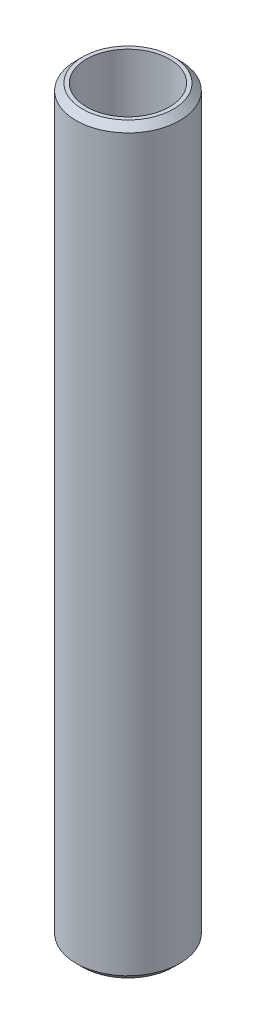
ISO-10303-21;
HEADER;
FILE_DESCRIPTION(('STEP AP214'),'2;1');
FILE_NAME('part.step','',(''),(''),'','','');
FILE_SCHEMA(('AUTOMOTIVE_DESIGN { 1 0 10303 214 1 1 1 1 }'));
ENDSEC;
DATA;
#1=APPLICATION_CONTEXT('core data for automotive mechanical design processes');
#2=APPLICATION_PROTOCOL_DEFINITION('international standard','automotive_design',2000,#1);
#3=PRODUCT_CONTEXT('',#1,'mechanical');
#4=PRODUCT('Part','Part','',(#3));
#5=PRODUCT_RELATED_PRODUCT_CATEGORY('part','',(#4));
#6=PRODUCT_DEFINITION_FORMATION('','',#4);
#7=PRODUCT_DEFINITION_CONTEXT('part definition',#1,'design');
#8=PRODUCT_DEFINITION('design','',#6,#7);
#9=PRODUCT_DEFINITION_SHAPE('','',#8);
#10=(LENGTH_UNIT() NAMED_UNIT(*) SI_UNIT(.MILLI.,.METRE.));
#11=(NAMED_UNIT(*) PLANE_ANGLE_UNIT() SI_UNIT($,.RADIAN.));
#12=(NAMED_UNIT(*) SI_UNIT($,.STERADIAN.) SOLID_ANGLE_UNIT());
#13=UNCERTAINTY_MEASURE_WITH_UNIT(LENGTH_MEASURE(1.E-05),#10,'distance_accuracy_value','');
#14=(GEOMETRIC_REPRESENTATION_CONTEXT(3) GLOBAL_UNCERTAINTY_ASSIGNED_CONTEXT((#13)) GLOBAL_UNIT_ASSIGNED_CONTEXT((#10,
#11,#12)) REPRESENTATION_CONTEXT('',''));
#15=CARTESIAN_POINT('',(0.,0.,0.));
#16=DIRECTION('',(0.,0.,1.));
#17=DIRECTION('',(1.,0.,0.));
#18=AXIS2_PLACEMENT_3D('',#15,#16,#17);
#19=CARTESIAN_POINT('',(0.,536.915649639822,0.));
#20=DIRECTION('',(0.,-1.,0.));
#21=DIRECTION('',(0.,0.,-1.));
#22=AXIS2_PLACEMENT_3D('',#19,#20,#21);
#23=CYLINDRICAL_SURFACE('',#22,37.5);
#24=CARTESIAN_POINT('',(0.,532.164765657502,0.));
#25=DIRECTION('',(0.,1.,0.));
#26=DIRECTION('',(0.,0.,1.));
#27=AXIS2_PLACEMENT_3D('',#24,#25,#26);
#28=CIRCLE('',#27,37.5);
#29=CARTESIAN_POINT('',(0.,532.164765657502,37.5));
#30=VERTEX_POINT('',#29);
#31=EDGE_CURVE('E50',#30,#30,#28,.F.);
#32=ORIENTED_EDGE('',*,*,#31,.T.);
#33=EDGE_LOOP('',(#32));
#34=FACE_BOUND('',#33,.T.);
#35=CARTESIAN_POINT('',(0.,4.7508839823206,0.));
#36=DIRECTION('',(0.,1.,0.));
#37=DIRECTION('',(0.,0.,1.));
#38=AXIS2_PLACEMENT_3D('',#35,#36,#37);
#39=CIRCLE('',#38,37.5);
#40=CARTESIAN_POINT('',(0.,4.7508839823206,37.5));
#41=VERTEX_POINT('',#40);
#42=EDGE_CURVE('E51',#41,#41,#39,.T.);
#43=ORIENTED_EDGE('',*,*,#42,.T.);
#44=EDGE_LOOP('',(#43));
#45=FACE_BOUND('',#44,.T.);
#46=ADVANCED_FACE('F39',(#34,#45),#23,.T.);
#47=CARTESIAN_POINT('',(0.,536.915649639822,0.));
#48=DIRECTION('',(0.,1.,0.));
#49=DIRECTION('',(0.,0.,1.));
#50=AXIS2_PLACEMENT_3D('',#47,#48,#49);
#51=PLANE('',#50);
#52=CARTESIAN_POINT('',(0.,536.915649639822,0.));
#53=DIRECTION('',(0.,1.,0.));
#54=DIRECTION('',(0.,0.,1.));
#55=AXIS2_PLACEMENT_3D('',#52,#53,#54);
#56=CIRCLE('',#55,32.7491160176793);
#57=CARTESIAN_POINT('',(0.,536.915649639822,32.7491160176793));
#58=VERTEX_POINT('',#57);
#59=EDGE_CURVE('E54',#58,#58,#56,.T.);
#60=ORIENTED_EDGE('',*,*,#59,.T.);
#61=EDGE_LOOP('',(#60));
#62=FACE_BOUND('',#61,.T.);
#63=CARTESIAN_POINT('',(0.,536.915649639822,0.));
#64=DIRECTION('',(0.,1.,0.));
#65=DIRECTION('',(0.,0.,1.));
#66=AXIS2_PLACEMENT_3D('',#63,#64,#65);
#67=CIRCLE('',#66,29.9902630118646);
#68=CARTESIAN_POINT('',(0.,536.915649639822,29.9902630118646));
#69=VERTEX_POINT('',#68);
#70=EDGE_CURVE('E58',#69,#69,#67,.T.);
#71=ORIENTED_EDGE('',*,*,#70,.F.);
#72=EDGE_LOOP('',(#71));
#73=FACE_BOUND('',#72,.T.);
#74=ADVANCED_FACE('F69',(#62,#73),#51,.T.);
#75=CARTESIAN_POINT('',(0.,0.,0.));
#76=DIRECTION('',(0.,1.,0.));
#77=DIRECTION('',(0.,0.,1.));
#78=AXIS2_PLACEMENT_3D('',#75,#76,#77);
#79=PLANE('',#78);
#80=CARTESIAN_POINT('',(0.,0.,0.));
#81=DIRECTION('',(0.,1.,0.));
#82=DIRECTION('',(0.,0.,1.));
#83=AXIS2_PLACEMENT_3D('',#80,#81,#82);
#84=CIRCLE('',#83,32.7491160176793);
#85=CARTESIAN_POINT('',(0.,0.,32.7491160176793));
#86=VERTEX_POINT('',#85);
#87=EDGE_CURVE('E10',#86,#86,#84,.F.);
#88=ORIENTED_EDGE('',*,*,#87,.T.);
#89=EDGE_LOOP('',(#88));
#90=FACE_BOUND('',#89,.T.);
#91=CARTESIAN_POINT('',(0.,0.,0.));
#92=DIRECTION('',(0.,1.,0.));
#93=DIRECTION('',(0.,0.,1.));
#94=AXIS2_PLACEMENT_3D('',#91,#92,#93);
#95=CIRCLE('',#94,29.9902630118646);
#96=CARTESIAN_POINT('',(0.,0.,29.9902630118646));
#97=VERTEX_POINT('',#96);
#98=EDGE_CURVE('E63',#97,#97,#95,.T.);
#99=ORIENTED_EDGE('',*,*,#98,.T.);
#100=EDGE_LOOP('',(#99));
#101=FACE_BOUND('',#100,.T.);
#102=ADVANCED_FACE('F75',(#90,#101),#79,.F.);
#103=CARTESIAN_POINT('',(0.,536.915649639822,0.));
#104=DIRECTION('',(0.,-1.,0.));
#105=DIRECTION('',(0.,0.,-1.));
#106=AXIS2_PLACEMENT_3D('',#103,#104,#105);
#107=CYLINDRICAL_SURFACE('',#106,29.9902630118646);
#108=ORIENTED_EDGE('',*,*,#70,.T.);
#109=EDGE_LOOP('',(#108));
#110=FACE_BOUND('',#109,.T.);
#111=ORIENTED_EDGE('',*,*,#98,.F.);
#112=EDGE_LOOP('',(#111));
#113=FACE_BOUND('',#112,.T.);
#114=ADVANCED_FACE('F70',(#110,#113),#107,.F.);
#115=CARTESIAN_POINT('',(0.,536.915649639822,0.));
#116=DIRECTION('',(0.,-1.,0.));
#117=DIRECTION('',(0.,0.,-1.));
#118=AXIS2_PLACEMENT_3D('',#115,#116,#117);
#119=CONICAL_SURFACE('',#118,32.7491160176793,0.785398163397457);
#120=ORIENTED_EDGE('',*,*,#31,.F.);
#121=EDGE_LOOP('',(#120));
#122=FACE_BOUND('',#121,.T.);
#123=ORIENTED_EDGE('',*,*,#59,.F.);
#124=EDGE_LOOP('',(#123));
#125=FACE_BOUND('',#124,.T.);
#126=ADVANCED_FACE('F81',(#122,#125),#119,.T.);
#127=CARTESIAN_POINT('',(0.,4.7508839823206,0.));
#128=DIRECTION('',(0.,1.,0.));
#129=DIRECTION('',(0.,0.,1.));
#130=AXIS2_PLACEMENT_3D('',#127,#128,#129);
#131=CONICAL_SURFACE('',#130,37.5,0.785398163397457);
#132=ORIENTED_EDGE('',*,*,#87,.F.);
#133=EDGE_LOOP('',(#132));
#134=FACE_BOUND('',#133,.T.);
#135=ORIENTED_EDGE('',*,*,#42,.F.);
#136=EDGE_LOOP('',(#135));
#137=FACE_BOUND('',#136,.T.);
#138=ADVANCED_FACE('F45',(#134,#137),#131,.T.);
#139=CLOSED_SHELL('',(#46,#74,#102,#114,#126,#138));
#140=MANIFOLD_SOLID_BREP('B2',#139);
#141=ADVANCED_BREP_SHAPE_REPRESENTATION('',(#18,#140),#14);
#142=SHAPE_DEFINITION_REPRESENTATION(#9,#141);
ENDSEC;
END-ISO-10303-21;
